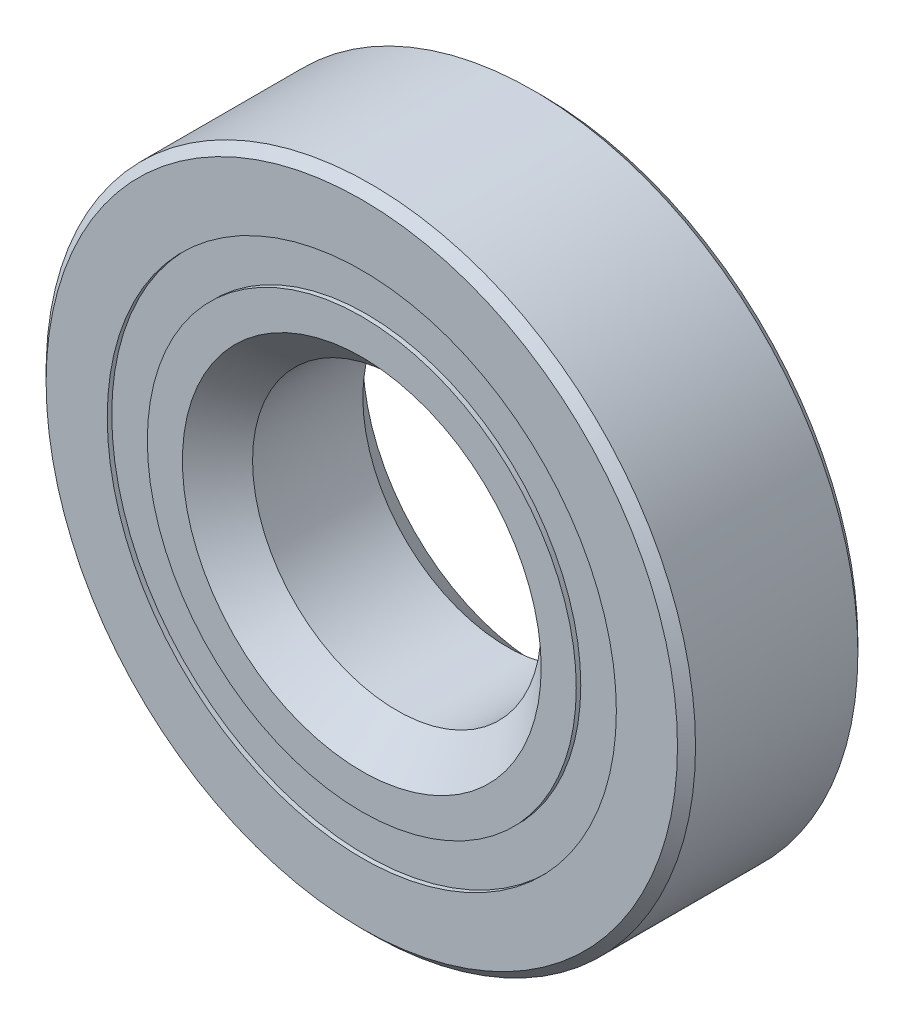
ISO-10303-21;
HEADER;
FILE_DESCRIPTION(('STEP AP214'),'2;1');
FILE_NAME('part.step','',(''),(''),'','','');
FILE_SCHEMA(('AUTOMOTIVE_DESIGN { 1 0 10303 214 1 1 1 1 }'));
ENDSEC;
DATA;
#1=APPLICATION_CONTEXT('core data for automotive mechanical design processes');
#2=APPLICATION_PROTOCOL_DEFINITION('international standard','automotive_design',2000,#1);
#3=PRODUCT_CONTEXT('',#1,'mechanical');
#4=PRODUCT('Part','Part','',(#3));
#5=PRODUCT_RELATED_PRODUCT_CATEGORY('part','',(#4));
#6=PRODUCT_DEFINITION_FORMATION('','',#4);
#7=PRODUCT_DEFINITION_CONTEXT('part definition',#1,'design');
#8=PRODUCT_DEFINITION('design','',#6,#7);
#9=PRODUCT_DEFINITION_SHAPE('','',#8);
#10=(LENGTH_UNIT() NAMED_UNIT(*) SI_UNIT(.MILLI.,.METRE.));
#11=(NAMED_UNIT(*) PLANE_ANGLE_UNIT() SI_UNIT($,.RADIAN.));
#12=(NAMED_UNIT(*) SI_UNIT($,.STERADIAN.) SOLID_ANGLE_UNIT());
#13=UNCERTAINTY_MEASURE_WITH_UNIT(LENGTH_MEASURE(1.E-05),#10,'distance_accuracy_value','');
#14=(GEOMETRIC_REPRESENTATION_CONTEXT(3) GLOBAL_UNCERTAINTY_ASSIGNED_CONTEXT((#13)) GLOBAL_UNIT_ASSIGNED_CONTEXT((#10,
#11,#12)) REPRESENTATION_CONTEXT('',''));
#15=CARTESIAN_POINT('',(0.,0.,0.));
#16=DIRECTION('',(0.,0.,1.));
#17=DIRECTION('',(1.,0.,0.));
#18=AXIS2_PLACEMENT_3D('',#15,#16,#17);
#19=CARTESIAN_POINT('',(0.,11.2006944444444,-1.97208773015606));
#20=DIRECTION('',(0.,0.,-1.));
#21=DIRECTION('',(-1.,0.,0.));
#22=AXIS2_PLACEMENT_3D('',#19,#20,#21);
#23=PLANE('',#22);
#24=CARTESIAN_POINT('',(0.,0.,-1.97208773015606));
#25=DIRECTION('',(0.,0.,1.));
#26=DIRECTION('',(1.,0.,0.));
#27=AXIS2_PLACEMENT_3D('',#24,#25,#26);
#28=CIRCLE('',#27,9.43680555555556);
#29=CARTESIAN_POINT('',(9.43680555555556,0.,-1.97208773015606));
#30=VERTEX_POINT('',#29);
#31=EDGE_CURVE('E11',#30,#30,#28,.T.);
#32=ORIENTED_EDGE('',*,*,#31,.F.);
#33=EDGE_LOOP('',(#32));
#34=FACE_BOUND('',#33,.T.);
#35=CARTESIAN_POINT('',(0.,0.,-1.97208773015606));
#36=DIRECTION('',(0.,0.,1.));
#37=DIRECTION('',(1.,0.,0.));
#38=AXIS2_PLACEMENT_3D('',#35,#36,#37);
#39=CIRCLE('',#38,11.2006944444444);
#40=CARTESIAN_POINT('',(11.2006944444444,0.,-1.97208773015606));
#41=VERTEX_POINT('',#40);
#42=EDGE_CURVE('E55',#41,#41,#39,.T.);
#43=ORIENTED_EDGE('',*,*,#42,.T.);
#44=EDGE_LOOP('',(#43));
#45=FACE_BOUND('',#44,.T.);
#46=ADVANCED_FACE('F41',(#34,#45),#23,.F.);
#47=CARTESIAN_POINT('',(0.,0.,3.96875));
#48=DIRECTION('',(0.,0.,1.));
#49=DIRECTION('',(1.,0.,0.));
#50=AXIS2_PLACEMENT_3D('',#47,#48,#49);
#51=CYLINDRICAL_SURFACE('',#50,9.43680555555556);
#52=CARTESIAN_POINT('',(0.,0.,-3.7703125));
#53=DIRECTION('',(0.,0.,1.));
#54=DIRECTION('',(1.,0.,0.));
#55=AXIS2_PLACEMENT_3D('',#52,#53,#54);
#56=CIRCLE('',#55,9.43680555555556);
#57=CARTESIAN_POINT('',(9.43680555555556,0.,-3.7703125));
#58=VERTEX_POINT('',#57);
#59=EDGE_CURVE('E47',#58,#58,#56,.T.);
#60=ORIENTED_EDGE('',*,*,#59,.F.);
#61=EDGE_LOOP('',(#60));
#62=FACE_BOUND('',#61,.T.);
#63=ORIENTED_EDGE('',*,*,#31,.T.);
#64=EDGE_LOOP('',(#63));
#65=FACE_BOUND('',#64,.T.);
#66=ADVANCED_FACE('F70',(#62,#65),#51,.F.);
#67=CARTESIAN_POINT('',(0.,11.2006944444444,-3.7703125));
#68=DIRECTION('',(0.,0.,1.));
#69=DIRECTION('',(1.,0.,0.));
#70=AXIS2_PLACEMENT_3D('',#67,#68,#69);
#71=PLANE('',#70);
#72=CARTESIAN_POINT('',(0.,0.,-3.7703125));
#73=DIRECTION('',(0.,0.,1.));
#74=DIRECTION('',(1.,0.,0.));
#75=AXIS2_PLACEMENT_3D('',#72,#73,#74);
#76=CIRCLE('',#75,11.2006944444444);
#77=CARTESIAN_POINT('',(11.2006944444444,0.,-3.7703125));
#78=VERTEX_POINT('',#77);
#79=EDGE_CURVE('E51',#78,#78,#76,.T.);
#80=ORIENTED_EDGE('',*,*,#79,.F.);
#81=EDGE_LOOP('',(#80));
#82=FACE_BOUND('',#81,.T.);
#83=ORIENTED_EDGE('',*,*,#59,.T.);
#84=EDGE_LOOP('',(#83));
#85=FACE_BOUND('',#84,.T.);
#86=ADVANCED_FACE('F65',(#82,#85),#71,.F.);
#87=CARTESIAN_POINT('',(0.,0.,3.96875));
#88=DIRECTION('',(0.,0.,1.));
#89=DIRECTION('',(1.,0.,0.));
#90=AXIS2_PLACEMENT_3D('',#87,#88,#89);
#91=CYLINDRICAL_SURFACE('',#90,11.2006944444444);
#92=ORIENTED_EDGE('',*,*,#42,.F.);
#93=EDGE_LOOP('',(#92));
#94=FACE_BOUND('',#93,.T.);
#95=ORIENTED_EDGE('',*,*,#79,.T.);
#96=EDGE_LOOP('',(#95));
#97=FACE_BOUND('',#96,.T.);
#98=ADVANCED_FACE('F62',(#94,#97),#91,.T.);
#99=CLOSED_SHELL('',(#46,#66,#86,#98));
#100=MANIFOLD_SOLID_BREP('B2',#99);
#101=CARTESIAN_POINT('',(0.,11.2006944444444,3.7703125));
#102=DIRECTION('',(0.,0.,-1.));
#103=DIRECTION('',(-1.,0.,0.));
#104=AXIS2_PLACEMENT_3D('',#101,#102,#103);
#105=PLANE('',#104);
#106=CARTESIAN_POINT('',(0.,0.,3.7703125));
#107=DIRECTION('',(0.,0.,1.));
#108=DIRECTION('',(1.,0.,0.));
#109=AXIS2_PLACEMENT_3D('',#106,#107,#108);
#110=CIRCLE('',#109,9.43680555555556);
#111=CARTESIAN_POINT('',(9.43680555555556,0.,3.7703125));
#112=VERTEX_POINT('',#111);
#113=EDGE_CURVE('E40',#112,#112,#110,.T.);
#114=ORIENTED_EDGE('',*,*,#113,.F.);
#115=EDGE_LOOP('',(#114));
#116=FACE_BOUND('',#115,.T.);
#117=CARTESIAN_POINT('',(0.,0.,3.7703125));
#118=DIRECTION('',(0.,0.,1.));
#119=DIRECTION('',(1.,0.,0.));
#120=AXIS2_PLACEMENT_3D('',#117,#118,#119);
#121=CIRCLE('',#120,11.2006944444444);
#122=CARTESIAN_POINT('',(11.2006944444444,0.,3.7703125));
#123=VERTEX_POINT('',#122);
#124=EDGE_CURVE('E122',#123,#123,#121,.T.);
#125=ORIENTED_EDGE('',*,*,#124,.T.);
#126=EDGE_LOOP('',(#125));
#127=FACE_BOUND('',#126,.T.);
#128=ADVANCED_FACE('F108',(#116,#127),#105,.F.);
#129=CARTESIAN_POINT('',(0.,0.,3.96875));
#130=DIRECTION('',(0.,0.,1.));
#131=DIRECTION('',(1.,0.,0.));
#132=AXIS2_PLACEMENT_3D('',#129,#130,#131);
#133=CYLINDRICAL_SURFACE('',#132,9.43680555555556);
#134=CARTESIAN_POINT('',(0.,0.,1.97208773015606));
#135=DIRECTION('',(0.,0.,1.));
#136=DIRECTION('',(1.,0.,0.));
#137=AXIS2_PLACEMENT_3D('',#134,#135,#136);
#138=CIRCLE('',#137,9.43680555555556);
#139=CARTESIAN_POINT('',(9.43680555555556,0.,1.97208773015606));
#140=VERTEX_POINT('',#139);
#141=EDGE_CURVE('E114',#140,#140,#138,.T.);
#142=ORIENTED_EDGE('',*,*,#141,.F.);
#143=EDGE_LOOP('',(#142));
#144=FACE_BOUND('',#143,.T.);
#145=ORIENTED_EDGE('',*,*,#113,.T.);
#146=EDGE_LOOP('',(#145));
#147=FACE_BOUND('',#146,.T.);
#148=ADVANCED_FACE('F137',(#144,#147),#133,.F.);
#149=CARTESIAN_POINT('',(0.,11.2006944444444,1.97208773015606));
#150=DIRECTION('',(0.,0.,1.));
#151=DIRECTION('',(1.,0.,0.));
#152=AXIS2_PLACEMENT_3D('',#149,#150,#151);
#153=PLANE('',#152);
#154=CARTESIAN_POINT('',(0.,0.,1.97208773015606));
#155=DIRECTION('',(0.,0.,1.));
#156=DIRECTION('',(1.,0.,0.));
#157=AXIS2_PLACEMENT_3D('',#154,#155,#156);
#158=CIRCLE('',#157,11.2006944444444);
#159=CARTESIAN_POINT('',(11.2006944444444,0.,1.97208773015606));
#160=VERTEX_POINT('',#159);
#161=EDGE_CURVE('E118',#160,#160,#158,.T.);
#162=ORIENTED_EDGE('',*,*,#161,.F.);
#163=EDGE_LOOP('',(#162));
#164=FACE_BOUND('',#163,.T.);
#165=ORIENTED_EDGE('',*,*,#141,.T.);
#166=EDGE_LOOP('',(#165));
#167=FACE_BOUND('',#166,.T.);
#168=ADVANCED_FACE('F132',(#164,#167),#153,.F.);
#169=CARTESIAN_POINT('',(0.,0.,3.96875));
#170=DIRECTION('',(0.,0.,1.));
#171=DIRECTION('',(1.,0.,0.));
#172=AXIS2_PLACEMENT_3D('',#169,#170,#171);
#173=CYLINDRICAL_SURFACE('',#172,11.2006944444444);
#174=ORIENTED_EDGE('',*,*,#124,.F.);
#175=EDGE_LOOP('',(#174));
#176=FACE_BOUND('',#175,.T.);
#177=ORIENTED_EDGE('',*,*,#161,.T.);
#178=EDGE_LOOP('',(#177));
#179=FACE_BOUND('',#178,.T.);
#180=ADVANCED_FACE('F129',(#176,#179),#173,.T.);
#181=CLOSED_SHELL('',(#128,#148,#168,#180));
#182=MANIFOLD_SOLID_BREP('B6',#181);
#183=CARTESIAN_POINT('',(-4.1970137357383,9.42664719104964,0.));
#184=DIRECTION('',(0.,0.,1.));
#185=DIRECTION('',(-0.406736643075789,0.913545457642606,0.));
#186=AXIS2_PLACEMENT_3D('',#183,#184,#185);
#187=SPHERICAL_SURFACE('',#186,1.97208773015606);
#188=CARTESIAN_POINT('',(-4.1970137357383,9.42664719104964,1.97208773015606));
#189=VERTEX_POINT('',#188);
#190=VERTEX_LOOP('',#189);
#191=FACE_BOUND('',#190,.T.);
#192=ADVANCED_FACE('F175',(#191),#187,.T.);
#193=CLOSED_SHELL('',(#192));
#194=MANIFOLD_SOLID_BREP('B35',#193);
#195=CARTESIAN_POINT('',(-7.66832566789478,6.90459144436556,0.));
#196=DIRECTION('',(0.,0.,1.));
#197=DIRECTION('',(-0.743144825477386,0.669130606358867,0.));
#198=AXIS2_PLACEMENT_3D('',#195,#196,#197);
#199=SPHERICAL_SURFACE('',#198,1.97208773015606);
#200=CARTESIAN_POINT('',(-7.66832566789478,6.90459144436556,1.97208773015606));
#201=VERTEX_POINT('',#200);
#202=VERTEX_LOOP('',#201);
#203=FACE_BOUND('',#202,.T.);
#204=ADVANCED_FACE('F206',(#203),#199,.T.);
#205=CLOSED_SHELL('',(#204));
#206=MANIFOLD_SOLID_BREP('B104',#205);
#207=CARTESIAN_POINT('',(-9.81371442752058,3.18866911070659,0.));
#208=DIRECTION('',(0.,0.,1.));
#209=DIRECTION('',(-0.95105651629515,0.309016994374957,0.));
#210=AXIS2_PLACEMENT_3D('',#207,#208,#209);
#211=SPHERICAL_SURFACE('',#210,1.97208773015606);
#212=CARTESIAN_POINT('',(-9.81371442752058,3.18866911070659,1.97208773015606));
#213=VERTEX_POINT('',#212);
#214=VERTEX_LOOP('',#213);
#215=FACE_BOUND('',#214,.T.);
#216=ADVANCED_FACE('F237',(#215),#211,.T.);
#217=CLOSED_SHELL('',(#216));
#218=MANIFOLD_SOLID_BREP('B171',#217);
#219=CARTESIAN_POINT('',(-10.2622228078314,-1.078603080343,0.));
#220=DIRECTION('',(0.,0.,1.));
#221=DIRECTION('',(-0.994521895368274,-0.104528463267644,0.));
#222=AXIS2_PLACEMENT_3D('',#219,#220,#221);
#223=SPHERICAL_SURFACE('',#222,1.97208773015606);
#224=CARTESIAN_POINT('',(-10.2622228078314,-1.078603080343,1.97208773015606));
#225=VERTEX_POINT('',#224);
#226=VERTEX_LOOP('',#225);
#227=FACE_BOUND('',#226,.T.);
#228=ADVANCED_FACE('F268',(#227),#223,.T.);
#229=CLOSED_SHELL('',(#228));
#230=MANIFOLD_SOLID_BREP('B202',#229);
#231=CARTESIAN_POINT('',(-8.93629963530072,-5.15937499999992,0.));
#232=DIRECTION('',(0.,0.,1.));
#233=DIRECTION('',(-0.866025403784443,-0.499999999999992,0.));
#234=AXIS2_PLACEMENT_3D('',#231,#232,#233);
#235=SPHERICAL_SURFACE('',#234,1.97208773015606);
#236=CARTESIAN_POINT('',(-8.93629963530072,-5.15937499999992,1.97208773015606));
#237=VERTEX_POINT('',#236);
#238=VERTEX_LOOP('',#237);
#239=FACE_BOUND('',#238,.T.);
#240=ADVANCED_FACE('F299',(#239),#235,.T.);
#241=CLOSED_SHELL('',(#240));
#242=MANIFOLD_SOLID_BREP('B233',#241);
#243=CARTESIAN_POINT('',(-6.06520907209303,-8.34804411070644,0.));
#244=DIRECTION('',(0.,0.,1.));
#245=DIRECTION('',(-0.58778525229248,-0.809016994374943,0.));
#246=AXIS2_PLACEMENT_3D('',#243,#244,#245);
#247=SPHERICAL_SURFACE('',#246,1.97208773015606);
#248=CARTESIAN_POINT('',(-6.06520907209303,-8.34804411070644,1.97208773015606));
#249=VERTEX_POINT('',#248);
#250=VERTEX_LOOP('',#249);
#251=FACE_BOUND('',#250,.T.);
#252=ADVANCED_FACE('F330',(#251),#247,.T.);
#253=CLOSED_SHELL('',(#252));
#254=MANIFOLD_SOLID_BREP('B264',#253);
#255=CARTESIAN_POINT('',(-2.14538875962583,-10.0932605550719,0.));
#256=DIRECTION('',(0.,0.,1.));
#257=DIRECTION('',(-0.207911690817766,-0.978147600733804,0.));
#258=AXIS2_PLACEMENT_3D('',#255,#256,#257);
#259=SPHERICAL_SURFACE('',#258,1.97208773015606);
#260=CARTESIAN_POINT('',(-2.14538875962583,-10.0932605550719,1.97208773015606));
#261=VERTEX_POINT('',#260);
#262=VERTEX_LOOP('',#261);
#263=FACE_BOUND('',#262,.T.);
#264=ADVANCED_FACE('F361',(#263),#259,.T.);
#265=CLOSED_SHELL('',(#264));
#266=MANIFOLD_SOLID_BREP('B295',#265);
#267=CARTESIAN_POINT('',(2.14538875962569,-10.093260555072,0.));
#268=DIRECTION('',(0.,0.,1.));
#269=DIRECTION('',(0.207911690817753,-0.978147600733807,0.));
#270=AXIS2_PLACEMENT_3D('',#267,#268,#269);
#271=SPHERICAL_SURFACE('',#270,1.97208773015606);
#272=CARTESIAN_POINT('',(2.14538875962569,-10.093260555072,1.97208773015606));
#273=VERTEX_POINT('',#272);
#274=VERTEX_LOOP('',#273);
#275=FACE_BOUND('',#274,.T.);
#276=ADVANCED_FACE('F392',(#275),#271,.T.);
#277=CLOSED_SHELL('',(#276));
#278=MANIFOLD_SOLID_BREP('B326',#277);
#279=CARTESIAN_POINT('',(6.06520907209291,-8.34804411070652,0.));
#280=DIRECTION('',(0.,0.,1.));
#281=DIRECTION('',(0.587785252292469,-0.80901699437495,0.));
#282=AXIS2_PLACEMENT_3D('',#279,#280,#281);
#283=SPHERICAL_SURFACE('',#282,1.97208773015606);
#284=CARTESIAN_POINT('',(6.06520907209291,-8.34804411070652,1.97208773015606));
#285=VERTEX_POINT('',#284);
#286=VERTEX_LOOP('',#285);
#287=FACE_BOUND('',#286,.T.);
#288=ADVANCED_FACE('F423',(#287),#283,.T.);
#289=CLOSED_SHELL('',(#288));
#290=MANIFOLD_SOLID_BREP('B357',#289);
#291=CARTESIAN_POINT('',(8.93629963530065,-5.15937500000004,0.));
#292=DIRECTION('',(0.,0.,1.));
#293=DIRECTION('',(0.866025403784436,-0.500000000000004,0.));
#294=AXIS2_PLACEMENT_3D('',#291,#292,#293);
#295=SPHERICAL_SURFACE('',#294,1.97208773015606);
#296=CARTESIAN_POINT('',(8.93629963530065,-5.15937500000004,1.97208773015606));
#297=VERTEX_POINT('',#296);
#298=VERTEX_LOOP('',#297);
#299=FACE_BOUND('',#298,.T.);
#300=ADVANCED_FACE('F454',(#299),#295,.T.);
#301=CLOSED_SHELL('',(#300));
#302=MANIFOLD_SOLID_BREP('B388',#301);
#303=CARTESIAN_POINT('',(10.2622228078314,-1.07860308034314,0.));
#304=DIRECTION('',(0.,0.,1.));
#305=DIRECTION('',(0.994521895368273,-0.104528463267657,0.));
#306=AXIS2_PLACEMENT_3D('',#303,#304,#305);
#307=SPHERICAL_SURFACE('',#306,1.97208773015606);
#308=CARTESIAN_POINT('',(10.2622228078314,-1.07860308034314,1.97208773015606));
#309=VERTEX_POINT('',#308);
#310=VERTEX_LOOP('',#309);
#311=FACE_BOUND('',#310,.T.);
#312=ADVANCED_FACE('F485',(#311),#307,.T.);
#313=CLOSED_SHELL('',(#312));
#314=MANIFOLD_SOLID_BREP('B419',#313);
#315=CARTESIAN_POINT('',(9.81371442752062,3.18866911070646,0.));
#316=DIRECTION('',(0.,0.,1.));
#317=DIRECTION('',(0.951056516295154,0.309016994374945,0.));
#318=AXIS2_PLACEMENT_3D('',#315,#316,#317);
#319=SPHERICAL_SURFACE('',#318,1.97208773015606);
#320=CARTESIAN_POINT('',(9.81371442752062,3.18866911070646,1.97208773015606));
#321=VERTEX_POINT('',#320);
#322=VERTEX_LOOP('',#321);
#323=FACE_BOUND('',#322,.T.);
#324=ADVANCED_FACE('F516',(#323),#319,.T.);
#325=CLOSED_SHELL('',(#324));
#326=MANIFOLD_SOLID_BREP('B450',#325);
#327=CARTESIAN_POINT('',(7.66832566789487,6.90459144436545,0.));
#328=DIRECTION('',(0.,0.,1.));
#329=DIRECTION('',(0.743144825477395,0.669130606358857,0.));
#330=AXIS2_PLACEMENT_3D('',#327,#328,#329);
#331=SPHERICAL_SURFACE('',#330,1.97208773015606);
#332=CARTESIAN_POINT('',(7.66832566789487,6.90459144436545,1.97208773015606));
#333=VERTEX_POINT('',#332);
#334=VERTEX_LOOP('',#333);
#335=FACE_BOUND('',#334,.T.);
#336=ADVANCED_FACE('F547',(#335),#331,.T.);
#337=CLOSED_SHELL('',(#336));
#338=MANIFOLD_SOLID_BREP('B481',#337);
#339=CARTESIAN_POINT('',(4.19701373573842,9.42664719104958,0.));
#340=DIRECTION('',(0.,0.,1.));
#341=DIRECTION('',(0.406736643075801,0.913545457642601,0.));
#342=AXIS2_PLACEMENT_3D('',#339,#340,#341);
#343=SPHERICAL_SURFACE('',#342,1.97208773015606);
#344=CARTESIAN_POINT('',(4.19701373573842,9.42664719104958,1.97208773015606));
#345=VERTEX_POINT('',#344);
#346=VERTEX_LOOP('',#345);
#347=FACE_BOUND('',#346,.T.);
#348=ADVANCED_FACE('F578',(#347),#343,.T.);
#349=CLOSED_SHELL('',(#348));
#350=MANIFOLD_SOLID_BREP('B512',#349);
#351=CARTESIAN_POINT('',(0.,10.31875,0.));
#352=DIRECTION('',(0.,0.,1.));
#353=DIRECTION('',(0.,1.,0.));
#354=AXIS2_PLACEMENT_3D('',#351,#352,#353);
#355=SPHERICAL_SURFACE('',#354,1.97208773015606);
#356=CARTESIAN_POINT('',(0.,10.31875,1.97208773015606));
#357=VERTEX_POINT('',#356);
#358=VERTEX_LOOP('',#357);
#359=FACE_BOUND('',#358,.T.);
#360=ADVANCED_FACE('F611',(#359),#355,.T.);
#361=CLOSED_SHELL('',(#360));
#362=MANIFOLD_SOLID_BREP('B543',#361);
#363=CARTESIAN_POINT('',(0.,9.43680555555556,3.96875));
#364=DIRECTION('',(0.,0.,-1.));
#365=DIRECTION('',(-1.,0.,0.));
#366=AXIS2_PLACEMENT_3D('',#363,#364,#365);
#367=PLANE('',#366);
#368=CARTESIAN_POINT('',(0.,0.,3.96875));
#369=DIRECTION('',(0.,0.,1.));
#370=DIRECTION('',(1.,0.,0.));
#371=AXIS2_PLACEMENT_3D('',#368,#369,#370);
#372=CIRCLE('',#371,7.89340277777778);
#373=CARTESIAN_POINT('',(7.89340277777778,0.,3.96875));
#374=VERTEX_POINT('',#373);
#375=EDGE_CURVE('E610',#374,#374,#372,.T.);
#376=ORIENTED_EDGE('',*,*,#375,.F.);
#377=EDGE_LOOP('',(#376));
#378=FACE_BOUND('',#377,.T.);
#379=CARTESIAN_POINT('',(0.,0.,3.96875));
#380=DIRECTION('',(0.,0.,1.));
#381=DIRECTION('',(1.,0.,0.));
#382=AXIS2_PLACEMENT_3D('',#379,#380,#381);
#383=CIRCLE('',#382,9.43680555555556);
#384=CARTESIAN_POINT('',(9.43680555555556,0.,3.96875));
#385=VERTEX_POINT('',#384);
#386=EDGE_CURVE('E658',#385,#385,#383,.T.);
#387=ORIENTED_EDGE('',*,*,#386,.T.);
#388=EDGE_LOOP('',(#387));
#389=FACE_BOUND('',#388,.T.);
#390=ADVANCED_FACE('F630',(#378,#389),#367,.F.);
#391=CARTESIAN_POINT('',(0.,0.,3.96875));
#392=DIRECTION('',(0.,0.,1.));
#393=DIRECTION('',(1.,0.,0.));
#394=AXIS2_PLACEMENT_3D('',#391,#392,#393);
#395=CONICAL_SURFACE('',#394,7.89340277777778,0.78539816339745);
#396=CARTESIAN_POINT('',(0.,0.,2.42534722222223));
#397=DIRECTION('',(0.,0.,1.));
#398=DIRECTION('',(1.,0.,0.));
#399=AXIS2_PLACEMENT_3D('',#396,#397,#398);
#400=CIRCLE('',#399,6.35);
#401=CARTESIAN_POINT('',(6.35,0.,2.42534722222223));
#402=VERTEX_POINT('',#401);
#403=EDGE_CURVE('E636',#402,#402,#400,.T.);
#404=ORIENTED_EDGE('',*,*,#403,.F.);
#405=EDGE_LOOP('',(#404));
#406=FACE_BOUND('',#405,.T.);
#407=ORIENTED_EDGE('',*,*,#375,.T.);
#408=EDGE_LOOP('',(#407));
#409=FACE_BOUND('',#408,.T.);
#410=ADVANCED_FACE('F695',(#406,#409),#395,.F.);
#411=CARTESIAN_POINT('',(0.,0.,3.96875));
#412=DIRECTION('',(0.,0.,1.));
#413=DIRECTION('',(1.,0.,0.));
#414=AXIS2_PLACEMENT_3D('',#411,#412,#413);
#415=CYLINDRICAL_SURFACE('',#414,6.35);
#416=CARTESIAN_POINT('',(0.,0.,-2.42534722222223));
#417=DIRECTION('',(0.,0.,1.));
#418=DIRECTION('',(1.,0.,0.));
#419=AXIS2_PLACEMENT_3D('',#416,#417,#418);
#420=CIRCLE('',#419,6.35);
#421=CARTESIAN_POINT('',(6.35,0.,-2.42534722222223));
#422=VERTEX_POINT('',#421);
#423=EDGE_CURVE('E640',#422,#422,#420,.T.);
#424=ORIENTED_EDGE('',*,*,#423,.F.);
#425=EDGE_LOOP('',(#424));
#426=FACE_BOUND('',#425,.T.);
#427=ORIENTED_EDGE('',*,*,#403,.T.);
#428=EDGE_LOOP('',(#427));
#429=FACE_BOUND('',#428,.T.);
#430=ADVANCED_FACE('F690',(#426,#429),#415,.F.);
#431=CARTESIAN_POINT('',(0.,0.,-2.42534722222223));
#432=DIRECTION('',(0.,0.,-1.));
#433=DIRECTION('',(-1.,0.,0.));
#434=AXIS2_PLACEMENT_3D('',#431,#432,#433);
#435=CONICAL_SURFACE('',#434,6.35,0.78539816339745);
#436=CARTESIAN_POINT('',(0.,0.,-3.96875));
#437=DIRECTION('',(0.,0.,1.));
#438=DIRECTION('',(1.,0.,0.));
#439=AXIS2_PLACEMENT_3D('',#436,#437,#438);
#440=CIRCLE('',#439,7.89340277777778);
#441=CARTESIAN_POINT('',(7.89340277777778,0.,-3.96875));
#442=VERTEX_POINT('',#441);
#443=EDGE_CURVE('E644',#442,#442,#440,.T.);
#444=ORIENTED_EDGE('',*,*,#443,.F.);
#445=EDGE_LOOP('',(#444));
#446=FACE_BOUND('',#445,.T.);
#447=ORIENTED_EDGE('',*,*,#423,.T.);
#448=EDGE_LOOP('',(#447));
#449=FACE_BOUND('',#448,.T.);
#450=ADVANCED_FACE('F684',(#446,#449),#435,.F.);
#451=CARTESIAN_POINT('',(0.,9.43680555555556,-3.96875));
#452=DIRECTION('',(0.,0.,1.));
#453=DIRECTION('',(1.,0.,0.));
#454=AXIS2_PLACEMENT_3D('',#451,#452,#453);
#455=PLANE('',#454);
#456=CARTESIAN_POINT('',(0.,0.,-3.96875));
#457=DIRECTION('',(0.,0.,1.));
#458=DIRECTION('',(1.,0.,0.));
#459=AXIS2_PLACEMENT_3D('',#456,#457,#458);
#460=CIRCLE('',#459,9.43680555555556);
#461=CARTESIAN_POINT('',(9.43680555555556,0.,-3.96875));
#462=VERTEX_POINT('',#461);
#463=EDGE_CURVE('E649',#462,#462,#460,.T.);
#464=ORIENTED_EDGE('',*,*,#463,.F.);
#465=EDGE_LOOP('',(#464));
#466=FACE_BOUND('',#465,.T.);
#467=ORIENTED_EDGE('',*,*,#443,.T.);
#468=EDGE_LOOP('',(#467));
#469=FACE_BOUND('',#468,.T.);
#470=ADVANCED_FACE('F678',(#466,#469),#455,.F.);
#471=CARTESIAN_POINT('',(0.,0.,3.96875));
#472=DIRECTION('',(0.,0.,1.));
#473=DIRECTION('',(1.,0.,0.));
#474=AXIS2_PLACEMENT_3D('',#471,#472,#473);
#475=CYLINDRICAL_SURFACE('',#474,9.43680555555556);
#476=CARTESIAN_POINT('',(0.,0.,-1.76388888888889));
#477=DIRECTION('',(0.,0.,1.));
#478=DIRECTION('',(1.,0.,0.));
#479=AXIS2_PLACEMENT_3D('',#476,#477,#478);
#480=CIRCLE('',#479,9.43680555555556);
#481=CARTESIAN_POINT('',(9.43680555555556,0.,-1.76388888888889));
#482=VERTEX_POINT('',#481);
#483=EDGE_CURVE('E652',#482,#482,#480,.T.);
#484=ORIENTED_EDGE('',*,*,#483,.F.);
#485=EDGE_LOOP('',(#484));
#486=FACE_BOUND('',#485,.T.);
#487=ORIENTED_EDGE('',*,*,#463,.T.);
#488=EDGE_LOOP('',(#487));
#489=FACE_BOUND('',#488,.T.);
#490=ADVANCED_FACE('F672',(#486,#489),#475,.T.);
#491=CARTESIAN_POINT('',(0.,0.,0.));
#492=DIRECTION('',(0.,0.,1.));
#493=DIRECTION('',(1.,0.,0.));
#494=AXIS2_PLACEMENT_3D('',#491,#492,#493);
#495=TOROIDAL_SURFACE('',#494,10.31875,1.97208773015606);
#496=CARTESIAN_POINT('',(0.,0.,1.76388888888889));
#497=DIRECTION('',(0.,0.,1.));
#498=DIRECTION('',(1.,0.,0.));
#499=AXIS2_PLACEMENT_3D('',#496,#497,#498);
#500=CIRCLE('',#499,9.43680555555556);
#501=CARTESIAN_POINT('',(9.43680555555556,0.,1.76388888888889));
#502=VERTEX_POINT('',#501);
#503=EDGE_CURVE('E655',#502,#502,#500,.T.);
#504=ORIENTED_EDGE('',*,*,#503,.F.);
#505=EDGE_LOOP('',(#504));
#506=FACE_BOUND('',#505,.T.);
#507=ORIENTED_EDGE('',*,*,#483,.T.);
#508=EDGE_LOOP('',(#507));
#509=FACE_BOUND('',#508,.T.);
#510=ADVANCED_FACE('F666',(#506,#509),#495,.F.);
#511=CARTESIAN_POINT('',(0.,0.,3.96875));
#512=DIRECTION('',(0.,0.,1.));
#513=DIRECTION('',(1.,0.,0.));
#514=AXIS2_PLACEMENT_3D('',#511,#512,#513);
#515=CYLINDRICAL_SURFACE('',#514,9.43680555555556);
#516=ORIENTED_EDGE('',*,*,#386,.F.);
#517=EDGE_LOOP('',(#516));
#518=FACE_BOUND('',#517,.T.);
#519=ORIENTED_EDGE('',*,*,#503,.T.);
#520=EDGE_LOOP('',(#519));
#521=FACE_BOUND('',#520,.T.);
#522=ADVANCED_FACE('F663',(#518,#521),#515,.T.);
#523=CLOSED_SHELL('',(#390,#410,#430,#450,#470,#490,#510,#522));
#524=MANIFOLD_SOLID_BREP('B574',#523);
#525=CARTESIAN_POINT('',(0.,0.,3.571875));
#526=DIRECTION('',(0.,0.,-1.));
#527=DIRECTION('',(-1.,0.,0.));
#528=AXIS2_PLACEMENT_3D('',#525,#526,#527);
#529=CONICAL_SURFACE('',#528,14.2875,0.785398163397448);
#530=CARTESIAN_POINT('',(0.,0.,3.96875));
#531=DIRECTION('',(0.,0.,1.));
#532=DIRECTION('',(1.,0.,0.));
#533=AXIS2_PLACEMENT_3D('',#530,#531,#532);
#534=CIRCLE('',#533,13.890625);
#535=CARTESIAN_POINT('',(13.890625,0.,3.96875));
#536=VERTEX_POINT('',#535);
#537=EDGE_CURVE('E779',#536,#536,#534,.T.);
#538=ORIENTED_EDGE('',*,*,#537,.F.);
#539=EDGE_LOOP('',(#538));
#540=FACE_BOUND('',#539,.T.);
#541=CARTESIAN_POINT('',(0.,0.,3.571875));
#542=DIRECTION('',(0.,0.,1.));
#543=DIRECTION('',(1.,0.,0.));
#544=AXIS2_PLACEMENT_3D('',#541,#542,#543);
#545=CIRCLE('',#544,14.2875);
#546=CARTESIAN_POINT('',(14.2875,0.,3.571875));
#547=VERTEX_POINT('',#546);
#548=EDGE_CURVE('E629',#547,#547,#545,.T.);
#549=ORIENTED_EDGE('',*,*,#548,.T.);
#550=EDGE_LOOP('',(#549));
#551=FACE_BOUND('',#550,.T.);
#552=ADVANCED_FACE('F751',(#540,#551),#529,.T.);
#553=CARTESIAN_POINT('',(0.,0.,3.96875));
#554=DIRECTION('',(0.,0.,1.));
#555=DIRECTION('',(1.,0.,0.));
#556=AXIS2_PLACEMENT_3D('',#553,#554,#555);
#557=CYLINDRICAL_SURFACE('',#556,14.2875);
#558=ORIENTED_EDGE('',*,*,#548,.F.);
#559=EDGE_LOOP('',(#558));
#560=FACE_BOUND('',#559,.T.);
#561=CARTESIAN_POINT('',(0.,0.,-3.571875));
#562=DIRECTION('',(0.,0.,1.));
#563=DIRECTION('',(1.,0.,0.));
#564=AXIS2_PLACEMENT_3D('',#561,#562,#563);
#565=CIRCLE('',#564,14.2875);
#566=CARTESIAN_POINT('',(14.2875,0.,-3.571875));
#567=VERTEX_POINT('',#566);
#568=EDGE_CURVE('E757',#567,#567,#565,.T.);
#569=ORIENTED_EDGE('',*,*,#568,.T.);
#570=EDGE_LOOP('',(#569));
#571=FACE_BOUND('',#570,.T.);
#572=ADVANCED_FACE('F786',(#560,#571),#557,.T.);
#573=CARTESIAN_POINT('',(0.,0.,-3.96875));
#574=DIRECTION('',(0.,0.,1.));
#575=DIRECTION('',(1.,0.,0.));
#576=AXIS2_PLACEMENT_3D('',#573,#574,#575);
#577=CONICAL_SURFACE('',#576,13.890625,0.785398163397448);
#578=ORIENTED_EDGE('',*,*,#568,.F.);
#579=EDGE_LOOP('',(#578));
#580=FACE_BOUND('',#579,.T.);
#581=CARTESIAN_POINT('',(0.,0.,-3.96875));
#582=DIRECTION('',(0.,0.,1.));
#583=DIRECTION('',(1.,0.,0.));
#584=AXIS2_PLACEMENT_3D('',#581,#582,#583);
#585=CIRCLE('',#584,13.890625);
#586=CARTESIAN_POINT('',(13.890625,0.,-3.96875));
#587=VERTEX_POINT('',#586);
#588=EDGE_CURVE('E761',#587,#587,#585,.T.);
#589=ORIENTED_EDGE('',*,*,#588,.T.);
#590=EDGE_LOOP('',(#589));
#591=FACE_BOUND('',#590,.T.);
#592=ADVANCED_FACE('F790',(#580,#591),#577,.T.);
#593=CARTESIAN_POINT('',(0.,13.890625,-3.96875));
#594=DIRECTION('',(0.,0.,1.));
#595=DIRECTION('',(1.,0.,0.));
#596=AXIS2_PLACEMENT_3D('',#593,#594,#595);
#597=PLANE('',#596);
#598=ORIENTED_EDGE('',*,*,#588,.F.);
#599=EDGE_LOOP('',(#598));
#600=FACE_BOUND('',#599,.T.);
#601=CARTESIAN_POINT('',(0.,0.,-3.96875));
#602=DIRECTION('',(0.,0.,1.));
#603=DIRECTION('',(1.,0.,0.));
#604=AXIS2_PLACEMENT_3D('',#601,#602,#603);
#605=CIRCLE('',#604,11.2006944444444);
#606=CARTESIAN_POINT('',(11.2006944444444,0.,-3.96875));
#607=VERTEX_POINT('',#606);
#608=EDGE_CURVE('E765',#607,#607,#605,.T.);
#609=ORIENTED_EDGE('',*,*,#608,.T.);
#610=EDGE_LOOP('',(#609));
#611=FACE_BOUND('',#610,.T.);
#612=ADVANCED_FACE('F795',(#600,#611),#597,.F.);
#613=CARTESIAN_POINT('',(0.,0.,3.96875));
#614=DIRECTION('',(0.,0.,1.));
#615=DIRECTION('',(1.,0.,0.));
#616=AXIS2_PLACEMENT_3D('',#613,#614,#615);
#617=CYLINDRICAL_SURFACE('',#616,11.2006944444444);
#618=ORIENTED_EDGE('',*,*,#608,.F.);
#619=EDGE_LOOP('',(#618));
#620=FACE_BOUND('',#619,.T.);
#621=CARTESIAN_POINT('',(0.,0.,-1.76388888888889));
#622=DIRECTION('',(0.,0.,1.));
#623=DIRECTION('',(1.,0.,0.));
#624=AXIS2_PLACEMENT_3D('',#621,#622,#623);
#625=CIRCLE('',#624,11.2006944444444);
#626=CARTESIAN_POINT('',(11.2006944444444,0.,-1.76388888888889));
#627=VERTEX_POINT('',#626);
#628=EDGE_CURVE('E770',#627,#627,#625,.T.);
#629=ORIENTED_EDGE('',*,*,#628,.T.);
#630=EDGE_LOOP('',(#629));
#631=FACE_BOUND('',#630,.T.);
#632=ADVANCED_FACE('F801',(#620,#631),#617,.F.);
#633=CARTESIAN_POINT('',(0.,0.,0.));
#634=DIRECTION('',(0.,0.,1.));
#635=DIRECTION('',(1.,0.,0.));
#636=AXIS2_PLACEMENT_3D('',#633,#634,#635);
#637=TOROIDAL_SURFACE('',#636,10.31875,1.97208773015606);
#638=ORIENTED_EDGE('',*,*,#628,.F.);
#639=EDGE_LOOP('',(#638));
#640=FACE_BOUND('',#639,.T.);
#641=CARTESIAN_POINT('',(0.,0.,1.76388888888889));
#642=DIRECTION('',(0.,0.,1.));
#643=DIRECTION('',(1.,0.,0.));
#644=AXIS2_PLACEMENT_3D('',#641,#642,#643);
#645=CIRCLE('',#644,11.2006944444444);
#646=CARTESIAN_POINT('',(11.2006944444444,0.,1.76388888888889));
#647=VERTEX_POINT('',#646);
#648=EDGE_CURVE('E773',#647,#647,#645,.T.);
#649=ORIENTED_EDGE('',*,*,#648,.T.);
#650=EDGE_LOOP('',(#649));
#651=FACE_BOUND('',#650,.T.);
#652=ADVANCED_FACE('F805',(#640,#651),#637,.F.);
#653=CARTESIAN_POINT('',(0.,0.,3.96875));
#654=DIRECTION('',(0.,0.,1.));
#655=DIRECTION('',(1.,0.,0.));
#656=AXIS2_PLACEMENT_3D('',#653,#654,#655);
#657=CYLINDRICAL_SURFACE('',#656,11.2006944444444);
#658=ORIENTED_EDGE('',*,*,#648,.F.);
#659=EDGE_LOOP('',(#658));
#660=FACE_BOUND('',#659,.T.);
#661=CARTESIAN_POINT('',(0.,0.,3.96875));
#662=DIRECTION('',(0.,0.,1.));
#663=DIRECTION('',(1.,0.,0.));
#664=AXIS2_PLACEMENT_3D('',#661,#662,#663);
#665=CIRCLE('',#664,11.2006944444444);
#666=CARTESIAN_POINT('',(11.2006944444444,0.,3.96875));
#667=VERTEX_POINT('',#666);
#668=EDGE_CURVE('E776',#667,#667,#665,.T.);
#669=ORIENTED_EDGE('',*,*,#668,.T.);
#670=EDGE_LOOP('',(#669));
#671=FACE_BOUND('',#670,.T.);
#672=ADVANCED_FACE('F809',(#660,#671),#657,.F.);
#673=CARTESIAN_POINT('',(0.,13.890625,3.96875));
#674=DIRECTION('',(0.,0.,-1.));
#675=DIRECTION('',(-1.,0.,0.));
#676=AXIS2_PLACEMENT_3D('',#673,#674,#675);
#677=PLANE('',#676);
#678=ORIENTED_EDGE('',*,*,#668,.F.);
#679=EDGE_LOOP('',(#678));
#680=FACE_BOUND('',#679,.T.);
#681=ORIENTED_EDGE('',*,*,#537,.T.);
#682=EDGE_LOOP('',(#681));
#683=FACE_BOUND('',#682,.T.);
#684=ADVANCED_FACE('F783',(#680,#683),#677,.F.);
#685=CLOSED_SHELL('',(#552,#572,#592,#612,#632,#652,#672,#684));
#686=MANIFOLD_SOLID_BREP('B605',#685);
#687=ADVANCED_BREP_SHAPE_REPRESENTATION('',(#18,#100,#182,#194,#206,#218,#230,#242,#254,#266,
#278,#290,#302,#314,#326,#338,#350,#362,#524,#686),#14);
#688=SHAPE_DEFINITION_REPRESENTATION(#9,#687);
ENDSEC;
END-ISO-10303-21;
